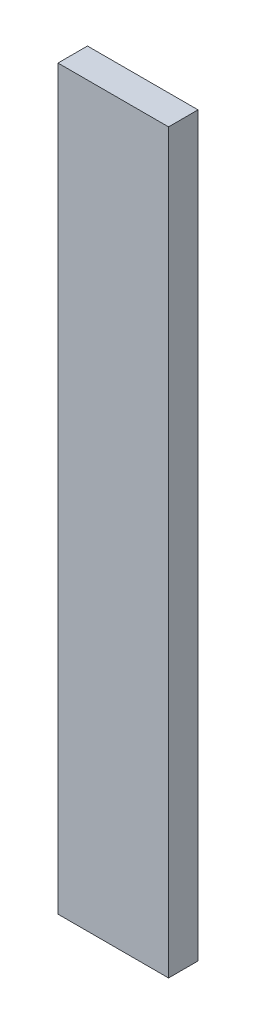
ISO-10303-21;
HEADER;
FILE_DESCRIPTION(('STEP AP214'),'2;1');
FILE_NAME('part.step','',(''),(''),'','','');
FILE_SCHEMA(('AUTOMOTIVE_DESIGN { 1 0 10303 214 1 1 1 1 }'));
ENDSEC;
DATA;
#1=APPLICATION_CONTEXT('core data for automotive mechanical design processes');
#2=APPLICATION_PROTOCOL_DEFINITION('international standard','automotive_design',2000,#1);
#3=PRODUCT_CONTEXT('',#1,'mechanical');
#4=PRODUCT('Part','Part','',(#3));
#5=PRODUCT_RELATED_PRODUCT_CATEGORY('part','',(#4));
#6=PRODUCT_DEFINITION_FORMATION('','',#4);
#7=PRODUCT_DEFINITION_CONTEXT('part definition',#1,'design');
#8=PRODUCT_DEFINITION('design','',#6,#7);
#9=PRODUCT_DEFINITION_SHAPE('','',#8);
#10=(LENGTH_UNIT() NAMED_UNIT(*) SI_UNIT(.MILLI.,.METRE.));
#11=(NAMED_UNIT(*) PLANE_ANGLE_UNIT() SI_UNIT($,.RADIAN.));
#12=(NAMED_UNIT(*) SI_UNIT($,.STERADIAN.) SOLID_ANGLE_UNIT());
#13=UNCERTAINTY_MEASURE_WITH_UNIT(LENGTH_MEASURE(1.E-05),#10,'distance_accuracy_value','');
#14=(GEOMETRIC_REPRESENTATION_CONTEXT(3) GLOBAL_UNCERTAINTY_ASSIGNED_CONTEXT((#13)) GLOBAL_UNIT_ASSIGNED_CONTEXT((#10,
#11,#12)) REPRESENTATION_CONTEXT('',''));
#15=CARTESIAN_POINT('',(0.,0.,0.));
#16=DIRECTION('',(0.,0.,1.));
#17=DIRECTION('',(1.,0.,0.));
#18=AXIS2_PLACEMENT_3D('',#15,#16,#17);
#19=CARTESIAN_POINT('',(30.,200.,16.));
#20=DIRECTION('',(-1.,0.,0.));
#21=DIRECTION('',(0.,-1.,0.));
#22=AXIS2_PLACEMENT_3D('',#19,#20,#21);
#23=PLANE('',#22);
#24=DIRECTION('',(0.,1.,0.));
#25=VECTOR('',#24,1.);
#26=CARTESIAN_POINT('',(30.,200.,0.));
#27=LINE('',#26,#25);
#28=CARTESIAN_POINT('',(30.,-200.,0.));
#29=VERTEX_POINT('',#28);
#30=CARTESIAN_POINT('',(30.,200.,0.));
#31=VERTEX_POINT('',#30);
#32=EDGE_CURVE('E107',#29,#31,#27,.T.);
#33=ORIENTED_EDGE('',*,*,#32,.T.);
#34=DIRECTION('',(0.,0.,-1.));
#35=VECTOR('',#34,1.);
#36=CARTESIAN_POINT('',(30.,200.,16.));
#37=LINE('',#36,#35);
#38=CARTESIAN_POINT('',(30.,200.,16.));
#39=VERTEX_POINT('',#38);
#40=EDGE_CURVE('E11',#39,#31,#37,.T.);
#41=ORIENTED_EDGE('',*,*,#40,.F.);
#42=DIRECTION('',(0.,1.,0.));
#43=VECTOR('',#42,1.);
#44=CARTESIAN_POINT('',(30.,200.,16.));
#45=LINE('',#44,#43);
#46=CARTESIAN_POINT('',(30.,-200.,16.));
#47=VERTEX_POINT('',#46);
#48=EDGE_CURVE('E91',#47,#39,#45,.T.);
#49=ORIENTED_EDGE('',*,*,#48,.F.);
#50=DIRECTION('',(0.,0.,-1.));
#51=VECTOR('',#50,1.);
#52=CARTESIAN_POINT('',(30.,-200.,16.));
#53=LINE('',#52,#51);
#54=EDGE_CURVE('E103',#47,#29,#53,.T.);
#55=ORIENTED_EDGE('',*,*,#54,.T.);
#56=EDGE_LOOP('',(#33,#41,#49,#55));
#57=FACE_BOUND('',#56,.T.);
#58=ADVANCED_FACE('F39',(#57),#23,.F.);
#59=CARTESIAN_POINT('',(-30.,200.,16.));
#60=DIRECTION('',(0.,-1.,0.));
#61=DIRECTION('',(0.,0.,-1.));
#62=AXIS2_PLACEMENT_3D('',#59,#60,#61);
#63=PLANE('',#62);
#64=DIRECTION('',(-1.,0.,0.));
#65=VECTOR('',#64,1.);
#66=CARTESIAN_POINT('',(-30.,200.,0.));
#67=LINE('',#66,#65);
#68=CARTESIAN_POINT('',(-30.,200.,0.));
#69=VERTEX_POINT('',#68);
#70=EDGE_CURVE('E96',#31,#69,#67,.T.);
#71=ORIENTED_EDGE('',*,*,#70,.T.);
#72=DIRECTION('',(0.,0.,-1.));
#73=VECTOR('',#72,1.);
#74=CARTESIAN_POINT('',(-30.,200.,16.));
#75=LINE('',#74,#73);
#76=CARTESIAN_POINT('',(-30.,200.,16.));
#77=VERTEX_POINT('',#76);
#78=EDGE_CURVE('E48',#77,#69,#75,.T.);
#79=ORIENTED_EDGE('',*,*,#78,.F.);
#80=DIRECTION('',(-1.,0.,0.));
#81=VECTOR('',#80,1.);
#82=CARTESIAN_POINT('',(-30.,200.,16.));
#83=LINE('',#82,#81);
#84=EDGE_CURVE('E86',#39,#77,#83,.T.);
#85=ORIENTED_EDGE('',*,*,#84,.F.);
#86=ORIENTED_EDGE('',*,*,#40,.T.);
#87=EDGE_LOOP('',(#71,#79,#85,#86));
#88=FACE_BOUND('',#87,.T.);
#89=ADVANCED_FACE('F95',(#88),#63,.F.);
#90=CARTESIAN_POINT('',(-30.,200.,16.));
#91=DIRECTION('',(1.,0.,0.));
#92=DIRECTION('',(0.,1.,0.));
#93=AXIS2_PLACEMENT_3D('',#90,#91,#92);
#94=PLANE('',#93);
#95=DIRECTION('',(0.,-1.,0.));
#96=VECTOR('',#95,1.);
#97=CARTESIAN_POINT('',(-30.,200.,0.));
#98=LINE('',#97,#96);
#99=CARTESIAN_POINT('',(-30.,-200.,0.));
#100=VERTEX_POINT('',#99);
#101=EDGE_CURVE('E73',#69,#100,#98,.T.);
#102=ORIENTED_EDGE('',*,*,#101,.T.);
#103=DIRECTION('',(0.,0.,-1.));
#104=VECTOR('',#103,1.);
#105=CARTESIAN_POINT('',(-30.,-200.,16.));
#106=LINE('',#105,#104);
#107=CARTESIAN_POINT('',(-30.,-200.,16.));
#108=VERTEX_POINT('',#107);
#109=EDGE_CURVE('E98',#108,#100,#106,.T.);
#110=ORIENTED_EDGE('',*,*,#109,.F.);
#111=DIRECTION('',(0.,-1.,0.));
#112=VECTOR('',#111,1.);
#113=CARTESIAN_POINT('',(-30.,200.,16.));
#114=LINE('',#113,#112);
#115=EDGE_CURVE('E89',#77,#108,#114,.T.);
#116=ORIENTED_EDGE('',*,*,#115,.F.);
#117=ORIENTED_EDGE('',*,*,#78,.T.);
#118=EDGE_LOOP('',(#102,#110,#116,#117));
#119=FACE_BOUND('',#118,.T.);
#120=ADVANCED_FACE('F99',(#119),#94,.F.);
#121=CARTESIAN_POINT('',(-30.,-200.,16.));
#122=DIRECTION('',(0.,1.,0.));
#123=DIRECTION('',(0.,0.,1.));
#124=AXIS2_PLACEMENT_3D('',#121,#122,#123);
#125=PLANE('',#124);
#126=DIRECTION('',(1.,0.,0.));
#127=VECTOR('',#126,1.);
#128=CARTESIAN_POINT('',(-30.,-200.,0.));
#129=LINE('',#128,#127);
#130=EDGE_CURVE('E79',#100,#29,#129,.T.);
#131=ORIENTED_EDGE('',*,*,#130,.T.);
#132=ORIENTED_EDGE('',*,*,#54,.F.);
#133=DIRECTION('',(1.,0.,0.));
#134=VECTOR('',#133,1.);
#135=CARTESIAN_POINT('',(-30.,-200.,16.));
#136=LINE('',#135,#134);
#137=EDGE_CURVE('E56',#108,#47,#136,.T.);
#138=ORIENTED_EDGE('',*,*,#137,.F.);
#139=ORIENTED_EDGE('',*,*,#109,.T.);
#140=EDGE_LOOP('',(#131,#132,#138,#139));
#141=FACE_BOUND('',#140,.T.);
#142=ADVANCED_FACE('F120',(#141),#125,.F.);
#143=CARTESIAN_POINT('',(0.,0.,16.));
#144=DIRECTION('',(0.,0.,1.));
#145=DIRECTION('',(1.,0.,0.));
#146=AXIS2_PLACEMENT_3D('',#143,#144,#145);
#147=PLANE('',#146);
#148=ORIENTED_EDGE('',*,*,#48,.T.);
#149=ORIENTED_EDGE('',*,*,#84,.T.);
#150=ORIENTED_EDGE('',*,*,#115,.T.);
#151=ORIENTED_EDGE('',*,*,#137,.T.);
#152=EDGE_LOOP('',(#148,#149,#150,#151));
#153=FACE_BOUND('',#152,.T.);
#154=ADVANCED_FACE('F87',(#153),#147,.T.);
#155=CARTESIAN_POINT('',(0.,0.,0.));
#156=DIRECTION('',(0.,0.,1.));
#157=DIRECTION('',(1.,0.,0.));
#158=AXIS2_PLACEMENT_3D('',#155,#156,#157);
#159=PLANE('',#158);
#160=ORIENTED_EDGE('',*,*,#32,.F.);
#161=ORIENTED_EDGE('',*,*,#130,.F.);
#162=ORIENTED_EDGE('',*,*,#101,.F.);
#163=ORIENTED_EDGE('',*,*,#70,.F.);
#164=EDGE_LOOP('',(#160,#161,#162,#163));
#165=FACE_BOUND('',#164,.T.);
#166=ADVANCED_FACE('F123',(#165),#159,.F.);
#167=CLOSED_SHELL('',(#58,#89,#120,#142,#154,#166));
#168=MANIFOLD_SOLID_BREP('B2',#167);
#169=ADVANCED_BREP_SHAPE_REPRESENTATION('',(#18,#168),#14);
#170=SHAPE_DEFINITION_REPRESENTATION(#9,#169);
ENDSEC;
END-ISO-10303-21;
